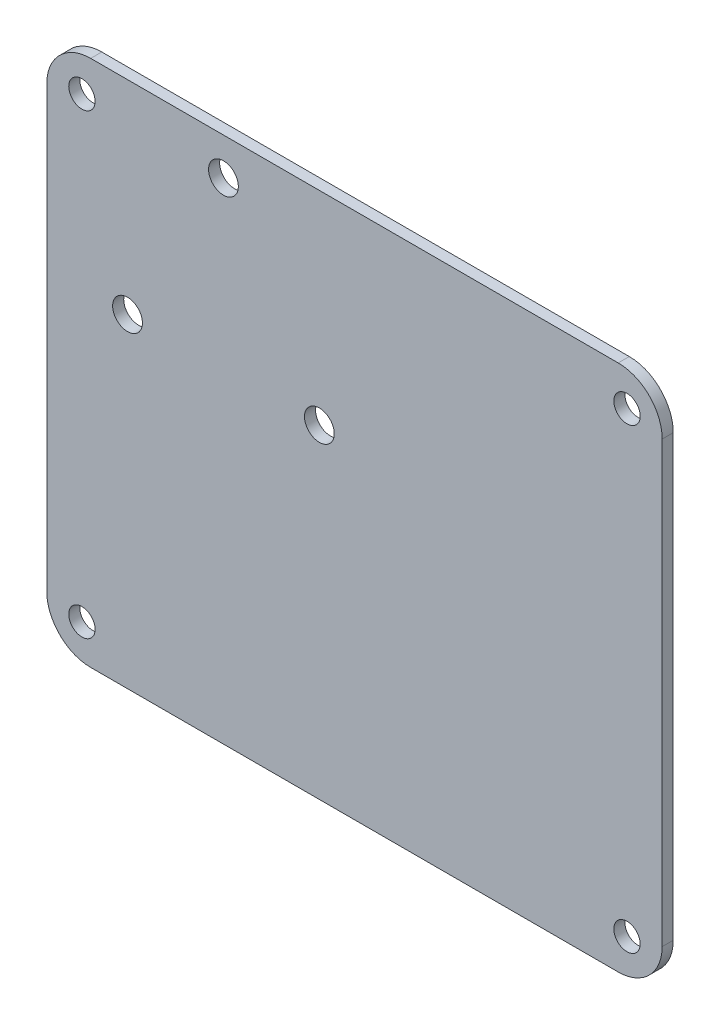
ISO-10303-21;
HEADER;
FILE_DESCRIPTION(('STEP AP214'),'2;1');
FILE_NAME('part.step','',(''),(''),'','','');
FILE_SCHEMA(('AUTOMOTIVE_DESIGN { 1 0 10303 214 1 1 1 1 }'));
ENDSEC;
DATA;
#1=APPLICATION_CONTEXT('core data for automotive mechanical design processes');
#2=APPLICATION_PROTOCOL_DEFINITION('international standard','automotive_design',2000,#1);
#3=PRODUCT_CONTEXT('',#1,'mechanical');
#4=PRODUCT('Part','Part','',(#3));
#5=PRODUCT_RELATED_PRODUCT_CATEGORY('part','',(#4));
#6=PRODUCT_DEFINITION_FORMATION('','',#4);
#7=PRODUCT_DEFINITION_CONTEXT('part definition',#1,'design');
#8=PRODUCT_DEFINITION('design','',#6,#7);
#9=PRODUCT_DEFINITION_SHAPE('','',#8);
#10=(LENGTH_UNIT() NAMED_UNIT(*) SI_UNIT(.MILLI.,.METRE.));
#11=(NAMED_UNIT(*) PLANE_ANGLE_UNIT() SI_UNIT($,.RADIAN.));
#12=(NAMED_UNIT(*) SI_UNIT($,.STERADIAN.) SOLID_ANGLE_UNIT());
#13=UNCERTAINTY_MEASURE_WITH_UNIT(LENGTH_MEASURE(1.E-05),#10,'distance_accuracy_value','');
#14=(GEOMETRIC_REPRESENTATION_CONTEXT(3) GLOBAL_UNCERTAINTY_ASSIGNED_CONTEXT((#13)) GLOBAL_UNIT_ASSIGNED_CONTEXT((#10,
#11,#12)) REPRESENTATION_CONTEXT('',''));
#15=CARTESIAN_POINT('',(0.,0.,0.));
#16=DIRECTION('',(0.,0.,1.));
#17=DIRECTION('',(1.,0.,0.));
#18=AXIS2_PLACEMENT_3D('',#15,#16,#17);
#19=CARTESIAN_POINT('',(-15.4904788230241,-8.03685752491666,1.6));
#20=DIRECTION('',(1.,0.,0.));
#21=DIRECTION('',(0.,0.,-1.));
#22=AXIS2_PLACEMENT_3D('',#19,#20,#21);
#23=PLANE('',#22);
#24=DIRECTION('',(0.,-1.,0.));
#25=VECTOR('',#24,1.);
#26=CARTESIAN_POINT('',(-15.4904788230241,-8.03685752491666,0.));
#27=LINE('',#26,#25);
#28=CARTESIAN_POINT('',(-15.4904788230241,61.8131424750833,0.));
#29=VERTEX_POINT('',#28);
#30=CARTESIAN_POINT('',(-15.4904788230241,-1.68685752491666,0.));
#31=VERTEX_POINT('',#30);
#32=EDGE_CURVE('E159',#29,#31,#27,.T.);
#33=ORIENTED_EDGE('',*,*,#32,.T.);
#34=DIRECTION('',(0.,0.,-1.));
#35=VECTOR('',#34,1.);
#36=CARTESIAN_POINT('',(-15.4904788230241,-1.68685752491666,1.6));
#37=LINE('',#36,#35);
#38=CARTESIAN_POINT('',(-15.4904788230241,-1.68685752491666,1.6));
#39=VERTEX_POINT('',#38);
#40=EDGE_CURVE('E11',#31,#39,#37,.F.);
#41=ORIENTED_EDGE('',*,*,#40,.T.);
#42=DIRECTION('',(0.,-1.,0.));
#43=VECTOR('',#42,1.);
#44=CARTESIAN_POINT('',(-15.4904788230241,-8.03685752491666,1.6));
#45=LINE('',#44,#43);
#46=CARTESIAN_POINT('',(-15.4904788230241,61.8131424750833,1.6));
#47=VERTEX_POINT('',#46);
#48=EDGE_CURVE('E127',#47,#39,#45,.T.);
#49=ORIENTED_EDGE('',*,*,#48,.F.);
#50=DIRECTION('',(0.,0.,-1.));
#51=VECTOR('',#50,1.);
#52=CARTESIAN_POINT('',(-15.4904788230241,61.8131424750833,1.6));
#53=LINE('',#52,#51);
#54=EDGE_CURVE('E43',#47,#29,#53,.T.);
#55=ORIENTED_EDGE('',*,*,#54,.T.);
#56=EDGE_LOOP('',(#33,#41,#49,#55));
#57=FACE_BOUND('',#56,.T.);
#58=ADVANCED_FACE('F35',(#57),#23,.F.);
#59=CARTESIAN_POINT('',(-15.4904788230241,-8.03685752491666,1.6));
#60=DIRECTION('',(0.,1.,0.));
#61=DIRECTION('',(0.,0.,1.));
#62=AXIS2_PLACEMENT_3D('',#59,#60,#61);
#63=PLANE('',#62);
#64=DIRECTION('',(1.,0.,0.));
#65=VECTOR('',#64,1.);
#66=CARTESIAN_POINT('',(-15.4904788230241,-8.03685752491666,0.));
#67=LINE('',#66,#65);
#68=CARTESIAN_POINT('',(-9.14047882302413,-8.03685752491666,0.));
#69=VERTEX_POINT('',#68);
#70=CARTESIAN_POINT('',(67.0595211769759,-8.03685752491666,0.));
#71=VERTEX_POINT('',#70);
#72=EDGE_CURVE('E132',#69,#71,#67,.T.);
#73=ORIENTED_EDGE('',*,*,#72,.T.);
#74=DIRECTION('',(0.,0.,-1.));
#75=VECTOR('',#74,1.);
#76=CARTESIAN_POINT('',(67.0595211769759,-8.03685752491666,1.6));
#77=LINE('',#76,#75);
#78=CARTESIAN_POINT('',(67.0595211769759,-8.03685752491666,1.6));
#79=VERTEX_POINT('',#78);
#80=EDGE_CURVE('E50',#71,#79,#77,.F.);
#81=ORIENTED_EDGE('',*,*,#80,.T.);
#82=DIRECTION('',(1.,0.,0.));
#83=VECTOR('',#82,1.);
#84=CARTESIAN_POINT('',(-15.4904788230241,-8.03685752491666,1.6));
#85=LINE('',#84,#83);
#86=CARTESIAN_POINT('',(-9.14047882302413,-8.03685752491666,1.6));
#87=VERTEX_POINT('',#86);
#88=EDGE_CURVE('E130',#87,#79,#85,.T.);
#89=ORIENTED_EDGE('',*,*,#88,.F.);
#90=DIRECTION('',(0.,0.,-1.));
#91=VECTOR('',#90,1.);
#92=CARTESIAN_POINT('',(-9.14047882302413,-8.03685752491666,1.6));
#93=LINE('',#92,#91);
#94=EDGE_CURVE('E151',#87,#69,#93,.T.);
#95=ORIENTED_EDGE('',*,*,#94,.T.);
#96=EDGE_LOOP('',(#73,#81,#89,#95));
#97=FACE_BOUND('',#96,.T.);
#98=ADVANCED_FACE('F251',(#97),#63,.F.);
#99=CARTESIAN_POINT('',(73.4095211769759,-8.03685752491666,1.6));
#100=DIRECTION('',(-1.,0.,0.));
#101=DIRECTION('',(0.,0.,1.));
#102=AXIS2_PLACEMENT_3D('',#99,#100,#101);
#103=PLANE('',#102);
#104=DIRECTION('',(0.,1.,0.));
#105=VECTOR('',#104,1.);
#106=CARTESIAN_POINT('',(73.4095211769759,-8.03685752491666,0.));
#107=LINE('',#106,#105);
#108=CARTESIAN_POINT('',(73.4095211769759,-1.68685752491666,0.));
#109=VERTEX_POINT('',#108);
#110=CARTESIAN_POINT('',(73.4095211769759,61.8131424750833,0.));
#111=VERTEX_POINT('',#110);
#112=EDGE_CURVE('E128',#109,#111,#107,.T.);
#113=ORIENTED_EDGE('',*,*,#112,.T.);
#114=DIRECTION('',(0.,0.,-1.));
#115=VECTOR('',#114,1.);
#116=CARTESIAN_POINT('',(73.4095211769759,61.8131424750833,1.6));
#117=LINE('',#116,#115);
#118=CARTESIAN_POINT('',(73.4095211769759,61.8131424750833,1.6));
#119=VERTEX_POINT('',#118);
#120=EDGE_CURVE('E106',#111,#119,#117,.F.);
#121=ORIENTED_EDGE('',*,*,#120,.T.);
#122=DIRECTION('',(0.,1.,0.));
#123=VECTOR('',#122,1.);
#124=CARTESIAN_POINT('',(73.4095211769759,-8.03685752491666,1.6));
#125=LINE('',#124,#123);
#126=CARTESIAN_POINT('',(73.4095211769759,-1.68685752491666,1.6));
#127=VERTEX_POINT('',#126);
#128=EDGE_CURVE('E171',#127,#119,#125,.T.);
#129=ORIENTED_EDGE('',*,*,#128,.F.);
#130=DIRECTION('',(0.,0.,-1.));
#131=VECTOR('',#130,1.);
#132=CARTESIAN_POINT('',(73.4095211769759,-1.68685752491666,1.6));
#133=LINE('',#132,#131);
#134=EDGE_CURVE('E111',#127,#109,#133,.T.);
#135=ORIENTED_EDGE('',*,*,#134,.T.);
#136=EDGE_LOOP('',(#113,#121,#129,#135));
#137=FACE_BOUND('',#136,.T.);
#138=ADVANCED_FACE('F256',(#137),#103,.F.);
#139=CARTESIAN_POINT('',(-15.4904788230241,68.1631424750833,1.6));
#140=DIRECTION('',(0.,-1.,0.));
#141=DIRECTION('',(0.,0.,-1.));
#142=AXIS2_PLACEMENT_3D('',#139,#140,#141);
#143=PLANE('',#142);
#144=DIRECTION('',(-1.,0.,0.));
#145=VECTOR('',#144,1.);
#146=CARTESIAN_POINT('',(-15.4904788230241,68.1631424750833,1.6));
#147=LINE('',#146,#145);
#148=CARTESIAN_POINT('',(67.0595211769759,68.1631424750833,1.6));
#149=VERTEX_POINT('',#148);
#150=CARTESIAN_POINT('',(-9.14047882302413,68.1631424750833,1.6));
#151=VERTEX_POINT('',#150);
#152=EDGE_CURVE('E121',#149,#151,#147,.T.);
#153=ORIENTED_EDGE('',*,*,#152,.F.);
#154=DIRECTION('',(0.,0.,-1.));
#155=VECTOR('',#154,1.);
#156=CARTESIAN_POINT('',(67.0595211769759,68.1631424750833,1.6));
#157=LINE('',#156,#155);
#158=CARTESIAN_POINT('',(67.0595211769759,68.1631424750833,0.));
#159=VERTEX_POINT('',#158);
#160=EDGE_CURVE('E105',#149,#159,#157,.T.);
#161=ORIENTED_EDGE('',*,*,#160,.T.);
#162=DIRECTION('',(-1.,0.,0.));
#163=VECTOR('',#162,1.);
#164=CARTESIAN_POINT('',(-15.4904788230241,68.1631424750833,0.));
#165=LINE('',#164,#163);
#166=CARTESIAN_POINT('',(-9.14047882302413,68.1631424750833,0.));
#167=VERTEX_POINT('',#166);
#168=EDGE_CURVE('E118',#159,#167,#165,.T.);
#169=ORIENTED_EDGE('',*,*,#168,.T.);
#170=DIRECTION('',(0.,0.,-1.));
#171=VECTOR('',#170,1.);
#172=CARTESIAN_POINT('',(-9.14047882302413,68.1631424750833,1.6));
#173=LINE('',#172,#171);
#174=EDGE_CURVE('E123',#167,#151,#173,.F.);
#175=ORIENTED_EDGE('',*,*,#174,.T.);
#176=EDGE_LOOP('',(#153,#161,#169,#175));
#177=FACE_BOUND('',#176,.T.);
#178=ADVANCED_FACE('F117',(#177),#143,.F.);
#179=CARTESIAN_POINT('',(0.,0.,1.6));
#180=DIRECTION('',(0.,0.,-1.));
#181=DIRECTION('',(-1.,0.,0.));
#182=AXIS2_PLACEMENT_3D('',#179,#180,#181);
#183=PLANE('',#182);
#184=CARTESIAN_POINT('',(-10.4104788230241,-2.95685752491665,1.6));
#185=DIRECTION('',(0.,0.,-1.));
#186=DIRECTION('',(1.,0.,0.));
#187=AXIS2_PLACEMENT_3D('',#184,#185,#186);
#188=CIRCLE('',#187,1.905);
#189=CARTESIAN_POINT('',(-8.50547882302412,-2.95685752491665,1.6));
#190=VERTEX_POINT('',#189);
#191=EDGE_CURVE('E199',#190,#190,#188,.T.);
#192=ORIENTED_EDGE('',*,*,#191,.T.);
#193=EDGE_LOOP('',(#192));
#194=FACE_BOUND('',#193,.T.);
#195=CARTESIAN_POINT('',(68.3295211769759,-2.95685752491663,1.6));
#196=DIRECTION('',(0.,0.,-1.));
#197=DIRECTION('',(-1.,0.,0.));
#198=AXIS2_PLACEMENT_3D('',#195,#196,#197);
#199=CIRCLE('',#198,1.90500000000001);
#200=CARTESIAN_POINT('',(66.4245211769759,-2.95685752491663,1.6));
#201=VERTEX_POINT('',#200);
#202=EDGE_CURVE('E205',#201,#201,#199,.T.);
#203=ORIENTED_EDGE('',*,*,#202,.T.);
#204=EDGE_LOOP('',(#203));
#205=FACE_BOUND('',#204,.T.);
#206=CARTESIAN_POINT('',(68.3295211769759,63.0831424750833,1.6));
#207=DIRECTION('',(0.,0.,-1.));
#208=DIRECTION('',(1.,0.,0.));
#209=AXIS2_PLACEMENT_3D('',#206,#207,#208);
#210=CIRCLE('',#209,1.90500000000001);
#211=CARTESIAN_POINT('',(70.2345211769759,63.0831424750833,1.6));
#212=VERTEX_POINT('',#211);
#213=EDGE_CURVE('E193',#212,#212,#210,.T.);
#214=ORIENTED_EDGE('',*,*,#213,.T.);
#215=EDGE_LOOP('',(#214));
#216=FACE_BOUND('',#215,.T.);
#217=CARTESIAN_POINT('',(-10.4104788230241,63.0831424750834,1.6));
#218=DIRECTION('',(0.,0.,-1.));
#219=DIRECTION('',(-1.,0.,0.));
#220=AXIS2_PLACEMENT_3D('',#217,#218,#219);
#221=CIRCLE('',#220,1.905);
#222=CARTESIAN_POINT('',(-12.3154788230241,63.0831424750834,1.6));
#223=VERTEX_POINT('',#222);
#224=EDGE_CURVE('E179',#223,#223,#221,.T.);
#225=ORIENTED_EDGE('',*,*,#224,.T.);
#226=EDGE_LOOP('',(#225));
#227=FACE_BOUND('',#226,.T.);
#228=CARTESIAN_POINT('',(23.8907060885274,38.7899969814613,1.6));
#229=DIRECTION('',(0.,0.,-1.));
#230=DIRECTION('',(-1.,0.,0.));
#231=AXIS2_PLACEMENT_3D('',#228,#229,#230);
#232=CIRCLE('',#231,2.15);
#233=CARTESIAN_POINT('',(21.7407060885274,38.7899969814613,1.6));
#234=VERTEX_POINT('',#233);
#235=EDGE_CURVE('E164',#234,#234,#232,.T.);
#236=ORIENTED_EDGE('',*,*,#235,.T.);
#237=EDGE_LOOP('',(#236));
#238=FACE_BOUND('',#237,.T.);
#239=CARTESIAN_POINT('',(-3.82210683257575,38.7899969814615,1.6));
#240=DIRECTION('',(0.,0.,-1.));
#241=DIRECTION('',(-1.,0.,0.));
#242=AXIS2_PLACEMENT_3D('',#239,#240,#241);
#243=CIRCLE('',#242,2.15);
#244=CARTESIAN_POINT('',(-5.97210683257574,38.7899969814615,1.6));
#245=VERTEX_POINT('',#244);
#246=EDGE_CURVE('E185',#245,#245,#243,.T.);
#247=ORIENTED_EDGE('',*,*,#246,.T.);
#248=EDGE_LOOP('',(#247));
#249=FACE_BOUND('',#248,.T.);
#250=CARTESIAN_POINT('',(10.0342996279759,62.7899969814623,1.6));
#251=DIRECTION('',(0.,0.,-1.));
#252=DIRECTION('',(-1.,0.,0.));
#253=AXIS2_PLACEMENT_3D('',#250,#251,#252);
#254=CIRCLE('',#253,2.15);
#255=CARTESIAN_POINT('',(7.88429962797586,62.7899969814623,1.6));
#256=VERTEX_POINT('',#255);
#257=EDGE_CURVE('E178',#256,#256,#254,.T.);
#258=ORIENTED_EDGE('',*,*,#257,.T.);
#259=EDGE_LOOP('',(#258));
#260=FACE_BOUND('',#259,.T.);
#261=ORIENTED_EDGE('',*,*,#128,.T.);
#262=CARTESIAN_POINT('',(67.0595211769759,61.8131424750833,1.6));
#263=DIRECTION('',(0.,0.,-1.));
#264=DIRECTION('',(-1.,0.,0.));
#265=AXIS2_PLACEMENT_3D('',#262,#263,#264);
#266=CIRCLE('',#265,6.35);
#267=EDGE_CURVE('E149',#119,#149,#266,.F.);
#268=ORIENTED_EDGE('',*,*,#267,.T.);
#269=ORIENTED_EDGE('',*,*,#152,.T.);
#270=CARTESIAN_POINT('',(-9.14047882302413,61.8131424750833,1.6));
#271=DIRECTION('',(0.,0.,-1.));
#272=DIRECTION('',(-1.,0.,0.));
#273=AXIS2_PLACEMENT_3D('',#270,#271,#272);
#274=CIRCLE('',#273,6.35);
#275=EDGE_CURVE('E144',#151,#47,#274,.F.);
#276=ORIENTED_EDGE('',*,*,#275,.T.);
#277=ORIENTED_EDGE('',*,*,#48,.T.);
#278=CARTESIAN_POINT('',(-9.14047882302413,-1.68685752491666,1.6));
#279=DIRECTION('',(0.,0.,-1.));
#280=DIRECTION('',(-1.,0.,0.));
#281=AXIS2_PLACEMENT_3D('',#278,#279,#280);
#282=CIRCLE('',#281,6.35);
#283=EDGE_CURVE('E57',#39,#87,#282,.F.);
#284=ORIENTED_EDGE('',*,*,#283,.T.);
#285=ORIENTED_EDGE('',*,*,#88,.T.);
#286=CARTESIAN_POINT('',(67.0595211769759,-1.68685752491666,1.6));
#287=DIRECTION('',(0.,0.,-1.));
#288=DIRECTION('',(-1.,0.,0.));
#289=AXIS2_PLACEMENT_3D('',#286,#287,#288);
#290=CIRCLE('',#289,6.35);
#291=EDGE_CURVE('E147',#79,#127,#290,.F.);
#292=ORIENTED_EDGE('',*,*,#291,.T.);
#293=EDGE_LOOP('',(#261,#268,#269,#276,#277,#284,#285,#292));
#294=FACE_BOUND('',#293,.T.);
#295=ADVANCED_FACE('F214',(#194,#205,#216,#227,#238,#249,#260,#294),#183,.F.);
#296=CARTESIAN_POINT('',(0.,0.,0.));
#297=DIRECTION('',(0.,0.,-1.));
#298=DIRECTION('',(-1.,0.,0.));
#299=AXIS2_PLACEMENT_3D('',#296,#297,#298);
#300=PLANE('',#299);
#301=CARTESIAN_POINT('',(-10.4104788230241,-2.95685752491665,0.));
#302=DIRECTION('',(0.,0.,-1.));
#303=DIRECTION('',(1.,0.,0.));
#304=AXIS2_PLACEMENT_3D('',#301,#302,#303);
#305=CIRCLE('',#304,1.905);
#306=CARTESIAN_POINT('',(-8.50547882302412,-2.95685752491665,0.));
#307=VERTEX_POINT('',#306);
#308=EDGE_CURVE('E196',#307,#307,#305,.T.);
#309=ORIENTED_EDGE('',*,*,#308,.F.);
#310=EDGE_LOOP('',(#309));
#311=FACE_BOUND('',#310,.T.);
#312=CARTESIAN_POINT('',(68.3295211769759,-2.95685752491663,0.));
#313=DIRECTION('',(0.,0.,-1.));
#314=DIRECTION('',(-1.,0.,0.));
#315=AXIS2_PLACEMENT_3D('',#312,#313,#314);
#316=CIRCLE('',#315,1.90500000000001);
#317=CARTESIAN_POINT('',(66.4245211769759,-2.95685752491663,0.));
#318=VERTEX_POINT('',#317);
#319=EDGE_CURVE('E202',#318,#318,#316,.T.);
#320=ORIENTED_EDGE('',*,*,#319,.F.);
#321=EDGE_LOOP('',(#320));
#322=FACE_BOUND('',#321,.T.);
#323=CARTESIAN_POINT('',(68.3295211769759,63.0831424750833,0.));
#324=DIRECTION('',(0.,0.,-1.));
#325=DIRECTION('',(1.,0.,0.));
#326=AXIS2_PLACEMENT_3D('',#323,#324,#325);
#327=CIRCLE('',#326,1.90500000000001);
#328=CARTESIAN_POINT('',(70.2345211769759,63.0831424750833,0.));
#329=VERTEX_POINT('',#328);
#330=EDGE_CURVE('E208',#329,#329,#327,.T.);
#331=ORIENTED_EDGE('',*,*,#330,.F.);
#332=EDGE_LOOP('',(#331));
#333=FACE_BOUND('',#332,.T.);
#334=CARTESIAN_POINT('',(-10.4104788230241,63.0831424750834,0.));
#335=DIRECTION('',(0.,0.,-1.));
#336=DIRECTION('',(-1.,0.,0.));
#337=AXIS2_PLACEMENT_3D('',#334,#335,#336);
#338=CIRCLE('',#337,1.905);
#339=CARTESIAN_POINT('',(-12.3154788230241,63.0831424750834,0.));
#340=VERTEX_POINT('',#339);
#341=EDGE_CURVE('E190',#340,#340,#338,.T.);
#342=ORIENTED_EDGE('',*,*,#341,.F.);
#343=EDGE_LOOP('',(#342));
#344=FACE_BOUND('',#343,.T.);
#345=CARTESIAN_POINT('',(23.8907060885274,38.7899969814613,0.));
#346=DIRECTION('',(0.,0.,-1.));
#347=DIRECTION('',(-1.,0.,0.));
#348=AXIS2_PLACEMENT_3D('',#345,#346,#347);
#349=CIRCLE('',#348,2.15);
#350=CARTESIAN_POINT('',(21.7407060885274,38.7899969814613,0.));
#351=VERTEX_POINT('',#350);
#352=EDGE_CURVE('E167',#351,#351,#349,.T.);
#353=ORIENTED_EDGE('',*,*,#352,.F.);
#354=EDGE_LOOP('',(#353));
#355=FACE_BOUND('',#354,.T.);
#356=CARTESIAN_POINT('',(-3.82210683257575,38.7899969814615,0.));
#357=DIRECTION('',(0.,0.,-1.));
#358=DIRECTION('',(-1.,0.,0.));
#359=AXIS2_PLACEMENT_3D('',#356,#357,#358);
#360=CIRCLE('',#359,2.15);
#361=CARTESIAN_POINT('',(-5.97210683257574,38.7899969814615,0.));
#362=VERTEX_POINT('',#361);
#363=EDGE_CURVE('E182',#362,#362,#360,.T.);
#364=ORIENTED_EDGE('',*,*,#363,.F.);
#365=EDGE_LOOP('',(#364));
#366=FACE_BOUND('',#365,.T.);
#367=CARTESIAN_POINT('',(10.0342996279759,62.7899969814623,0.));
#368=DIRECTION('',(0.,0.,-1.));
#369=DIRECTION('',(-1.,0.,0.));
#370=AXIS2_PLACEMENT_3D('',#367,#368,#369);
#371=CIRCLE('',#370,2.15);
#372=CARTESIAN_POINT('',(7.88429962797586,62.7899969814623,0.));
#373=VERTEX_POINT('',#372);
#374=EDGE_CURVE('E175',#373,#373,#371,.T.);
#375=ORIENTED_EDGE('',*,*,#374,.F.);
#376=EDGE_LOOP('',(#375));
#377=FACE_BOUND('',#376,.T.);
#378=ORIENTED_EDGE('',*,*,#168,.F.);
#379=CARTESIAN_POINT('',(67.0595211769759,61.8131424750833,0.));
#380=DIRECTION('',(0.,0.,-1.));
#381=DIRECTION('',(-1.,0.,0.));
#382=AXIS2_PLACEMENT_3D('',#379,#380,#381);
#383=CIRCLE('',#382,6.35);
#384=EDGE_CURVE('E101',#159,#111,#383,.T.);
#385=ORIENTED_EDGE('',*,*,#384,.T.);
#386=ORIENTED_EDGE('',*,*,#112,.F.);
#387=CARTESIAN_POINT('',(67.0595211769759,-1.68685752491666,0.));
#388=DIRECTION('',(0.,0.,-1.));
#389=DIRECTION('',(-1.,0.,0.));
#390=AXIS2_PLACEMENT_3D('',#387,#388,#389);
#391=CIRCLE('',#390,6.35);
#392=EDGE_CURVE('E112',#109,#71,#391,.T.);
#393=ORIENTED_EDGE('',*,*,#392,.T.);
#394=ORIENTED_EDGE('',*,*,#72,.F.);
#395=CARTESIAN_POINT('',(-9.14047882302413,-1.68685752491666,0.));
#396=DIRECTION('',(0.,0.,-1.));
#397=DIRECTION('',(-1.,0.,0.));
#398=AXIS2_PLACEMENT_3D('',#395,#396,#397);
#399=CIRCLE('',#398,6.35);
#400=EDGE_CURVE('E138',#69,#31,#399,.T.);
#401=ORIENTED_EDGE('',*,*,#400,.T.);
#402=ORIENTED_EDGE('',*,*,#32,.F.);
#403=CARTESIAN_POINT('',(-9.14047882302413,61.8131424750833,0.));
#404=DIRECTION('',(0.,0.,-1.));
#405=DIRECTION('',(-1.,0.,0.));
#406=AXIS2_PLACEMENT_3D('',#403,#404,#405);
#407=CIRCLE('',#406,6.35);
#408=EDGE_CURVE('E122',#29,#167,#407,.T.);
#409=ORIENTED_EDGE('',*,*,#408,.T.);
#410=EDGE_LOOP('',(#378,#385,#386,#393,#394,#401,#402,#409));
#411=FACE_BOUND('',#410,.T.);
#412=ADVANCED_FACE('F125',(#311,#322,#333,#344,#355,#366,#377,#411),#300,.T.);
#413=CARTESIAN_POINT('',(10.0342996279759,62.7899969814623,1.6));
#414=DIRECTION('',(0.,0.,-1.));
#415=DIRECTION('',(-1.,0.,0.));
#416=AXIS2_PLACEMENT_3D('',#413,#414,#415);
#417=CYLINDRICAL_SURFACE('',#416,2.15);
#418=ORIENTED_EDGE('',*,*,#257,.F.);
#419=EDGE_LOOP('',(#418));
#420=FACE_BOUND('',#419,.T.);
#421=ORIENTED_EDGE('',*,*,#374,.T.);
#422=EDGE_LOOP('',(#421));
#423=FACE_BOUND('',#422,.T.);
#424=ADVANCED_FACE('F227',(#420,#423),#417,.F.);
#425=CARTESIAN_POINT('',(-3.82210683257575,38.7899969814615,1.6));
#426=DIRECTION('',(0.,0.,-1.));
#427=DIRECTION('',(-1.,0.,0.));
#428=AXIS2_PLACEMENT_3D('',#425,#426,#427);
#429=CYLINDRICAL_SURFACE('',#428,2.15);
#430=ORIENTED_EDGE('',*,*,#246,.F.);
#431=EDGE_LOOP('',(#430));
#432=FACE_BOUND('',#431,.T.);
#433=ORIENTED_EDGE('',*,*,#363,.T.);
#434=EDGE_LOOP('',(#433));
#435=FACE_BOUND('',#434,.T.);
#436=ADVANCED_FACE('F239',(#432,#435),#429,.F.);
#437=CARTESIAN_POINT('',(23.8907060885274,38.7899969814613,1.6));
#438=DIRECTION('',(0.,0.,-1.));
#439=DIRECTION('',(-1.,0.,0.));
#440=AXIS2_PLACEMENT_3D('',#437,#438,#439);
#441=CYLINDRICAL_SURFACE('',#440,2.15);
#442=ORIENTED_EDGE('',*,*,#235,.F.);
#443=EDGE_LOOP('',(#442));
#444=FACE_BOUND('',#443,.T.);
#445=ORIENTED_EDGE('',*,*,#352,.T.);
#446=EDGE_LOOP('',(#445));
#447=FACE_BOUND('',#446,.T.);
#448=ADVANCED_FACE('F245',(#444,#447),#441,.F.);
#449=CARTESIAN_POINT('',(-10.4104788230241,63.0831424750834,1.6));
#450=DIRECTION('',(0.,0.,-1.));
#451=DIRECTION('',(-1.,0.,0.));
#452=AXIS2_PLACEMENT_3D('',#449,#450,#451);
#453=CYLINDRICAL_SURFACE('',#452,1.905);
#454=ORIENTED_EDGE('',*,*,#224,.F.);
#455=EDGE_LOOP('',(#454));
#456=FACE_BOUND('',#455,.T.);
#457=ORIENTED_EDGE('',*,*,#341,.T.);
#458=EDGE_LOOP('',(#457));
#459=FACE_BOUND('',#458,.T.);
#460=ADVANCED_FACE('F221',(#456,#459),#453,.F.);
#461=CARTESIAN_POINT('',(68.3295211769759,63.0831424750833,1.6));
#462=DIRECTION('',(0.,0.,-1.));
#463=DIRECTION('',(-1.,0.,0.));
#464=AXIS2_PLACEMENT_3D('',#461,#462,#463);
#465=CYLINDRICAL_SURFACE('',#464,1.90500000000001);
#466=ORIENTED_EDGE('',*,*,#213,.F.);
#467=EDGE_LOOP('',(#466));
#468=FACE_BOUND('',#467,.T.);
#469=ORIENTED_EDGE('',*,*,#330,.T.);
#470=EDGE_LOOP('',(#469));
#471=FACE_BOUND('',#470,.T.);
#472=ADVANCED_FACE('F217',(#468,#471),#465,.F.);
#473=CARTESIAN_POINT('',(68.3295211769759,-2.95685752491663,1.6));
#474=DIRECTION('',(0.,0.,-1.));
#475=DIRECTION('',(-1.,0.,0.));
#476=AXIS2_PLACEMENT_3D('',#473,#474,#475);
#477=CYLINDRICAL_SURFACE('',#476,1.90500000000001);
#478=ORIENTED_EDGE('',*,*,#202,.F.);
#479=EDGE_LOOP('',(#478));
#480=FACE_BOUND('',#479,.T.);
#481=ORIENTED_EDGE('',*,*,#319,.T.);
#482=EDGE_LOOP('',(#481));
#483=FACE_BOUND('',#482,.T.);
#484=ADVANCED_FACE('F220',(#480,#483),#477,.F.);
#485=CARTESIAN_POINT('',(-10.4104788230241,-2.95685752491665,1.6));
#486=DIRECTION('',(0.,0.,-1.));
#487=DIRECTION('',(-1.,0.,0.));
#488=AXIS2_PLACEMENT_3D('',#485,#486,#487);
#489=CYLINDRICAL_SURFACE('',#488,1.905);
#490=ORIENTED_EDGE('',*,*,#191,.F.);
#491=EDGE_LOOP('',(#490));
#492=FACE_BOUND('',#491,.T.);
#493=ORIENTED_EDGE('',*,*,#308,.T.);
#494=EDGE_LOOP('',(#493));
#495=FACE_BOUND('',#494,.T.);
#496=ADVANCED_FACE('F263',(#492,#495),#489,.F.);
#497=CARTESIAN_POINT('',(67.0595211769759,61.8131424750833,1.6));
#498=DIRECTION('',(0.,0.,-1.));
#499=DIRECTION('',(-1.,0.,0.));
#500=AXIS2_PLACEMENT_3D('',#497,#498,#499);
#501=CYLINDRICAL_SURFACE('',#500,6.35);
#502=ORIENTED_EDGE('',*,*,#267,.F.);
#503=ORIENTED_EDGE('',*,*,#120,.F.);
#504=ORIENTED_EDGE('',*,*,#384,.F.);
#505=ORIENTED_EDGE('',*,*,#160,.F.);
#506=EDGE_LOOP('',(#502,#503,#504,#505));
#507=FACE_BOUND('',#506,.T.);
#508=ADVANCED_FACE('F104',(#507),#501,.T.);
#509=CARTESIAN_POINT('',(67.0595211769759,-1.68685752491666,1.6));
#510=DIRECTION('',(0.,0.,-1.));
#511=DIRECTION('',(-1.,0.,0.));
#512=AXIS2_PLACEMENT_3D('',#509,#510,#511);
#513=CYLINDRICAL_SURFACE('',#512,6.35);
#514=ORIENTED_EDGE('',*,*,#291,.F.);
#515=ORIENTED_EDGE('',*,*,#80,.F.);
#516=ORIENTED_EDGE('',*,*,#392,.F.);
#517=ORIENTED_EDGE('',*,*,#134,.F.);
#518=EDGE_LOOP('',(#514,#515,#516,#517));
#519=FACE_BOUND('',#518,.T.);
#520=ADVANCED_FACE('F262',(#519),#513,.T.);
#521=CARTESIAN_POINT('',(-9.14047882302413,-1.68685752491666,1.6));
#522=DIRECTION('',(0.,0.,-1.));
#523=DIRECTION('',(-1.,0.,0.));
#524=AXIS2_PLACEMENT_3D('',#521,#522,#523);
#525=CYLINDRICAL_SURFACE('',#524,6.35);
#526=ORIENTED_EDGE('',*,*,#283,.F.);
#527=ORIENTED_EDGE('',*,*,#40,.F.);
#528=ORIENTED_EDGE('',*,*,#400,.F.);
#529=ORIENTED_EDGE('',*,*,#94,.F.);
#530=EDGE_LOOP('',(#526,#527,#528,#529));
#531=FACE_BOUND('',#530,.T.);
#532=ADVANCED_FACE('F265',(#531),#525,.T.);
#533=CARTESIAN_POINT('',(-9.14047882302413,61.8131424750833,1.6));
#534=DIRECTION('',(0.,0.,-1.));
#535=DIRECTION('',(-1.,0.,0.));
#536=AXIS2_PLACEMENT_3D('',#533,#534,#535);
#537=CYLINDRICAL_SURFACE('',#536,6.35);
#538=ORIENTED_EDGE('',*,*,#275,.F.);
#539=ORIENTED_EDGE('',*,*,#174,.F.);
#540=ORIENTED_EDGE('',*,*,#408,.F.);
#541=ORIENTED_EDGE('',*,*,#54,.F.);
#542=EDGE_LOOP('',(#538,#539,#540,#541));
#543=FACE_BOUND('',#542,.T.);
#544=ADVANCED_FACE('F37',(#543),#537,.T.);
#545=CLOSED_SHELL('',(#58,#98,#138,#178,#295,#412,#424,#436,#448,#460,#472,#484,#496,#508,#520,
#532,#544));
#546=MANIFOLD_SOLID_BREP('B2',#545);
#547=ADVANCED_BREP_SHAPE_REPRESENTATION('',(#18,#546),#14);
#548=SHAPE_DEFINITION_REPRESENTATION(#9,#547);
ENDSEC;
END-ISO-10303-21;
